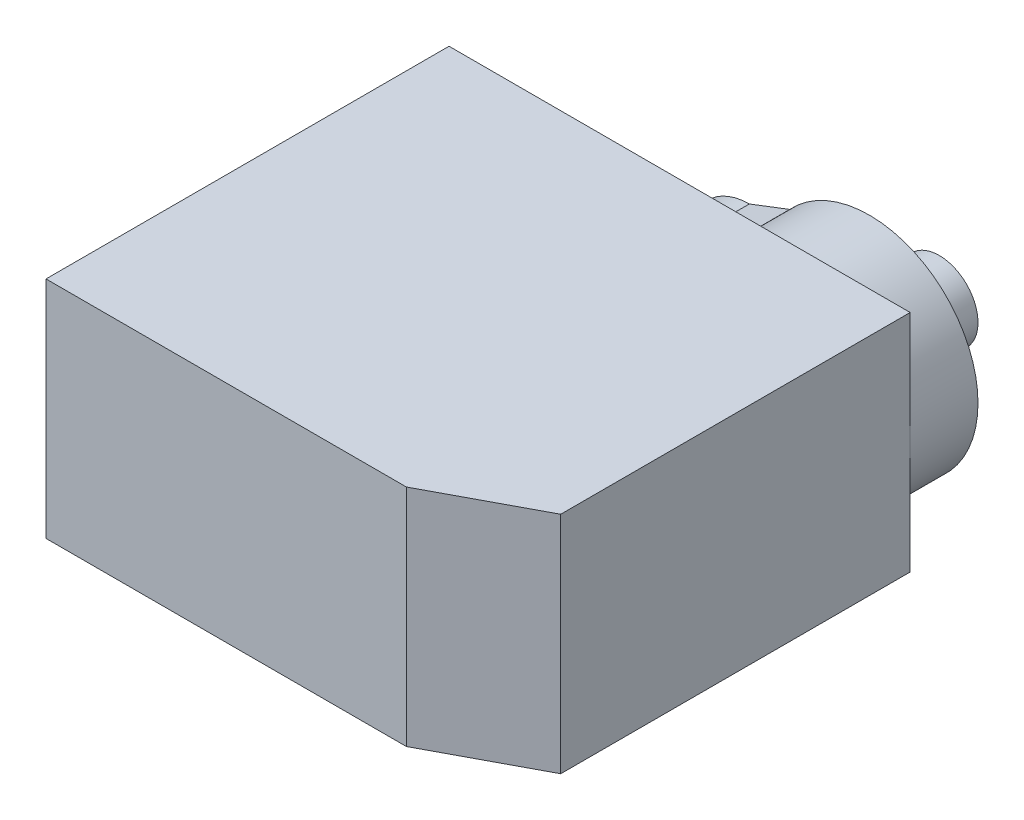
ISO-10303-21;
HEADER;
FILE_DESCRIPTION(('STEP AP214'),'2;1');
FILE_NAME('part.step','',(''),(''),'','','');
FILE_SCHEMA(('AUTOMOTIVE_DESIGN { 1 0 10303 214 1 1 1 1 }'));
ENDSEC;
DATA;
#1=APPLICATION_CONTEXT('core data for automotive mechanical design processes');
#2=APPLICATION_PROTOCOL_DEFINITION('international standard','automotive_design',2000,#1);
#3=PRODUCT_CONTEXT('',#1,'mechanical');
#4=PRODUCT('Part','Part','',(#3));
#5=PRODUCT_RELATED_PRODUCT_CATEGORY('part','',(#4));
#6=PRODUCT_DEFINITION_FORMATION('','',#4);
#7=PRODUCT_DEFINITION_CONTEXT('part definition',#1,'design');
#8=PRODUCT_DEFINITION('design','',#6,#7);
#9=PRODUCT_DEFINITION_SHAPE('','',#8);
#10=(LENGTH_UNIT() NAMED_UNIT(*) SI_UNIT(.MILLI.,.METRE.));
#11=(NAMED_UNIT(*) PLANE_ANGLE_UNIT() SI_UNIT($,.RADIAN.));
#12=(NAMED_UNIT(*) SI_UNIT($,.STERADIAN.) SOLID_ANGLE_UNIT());
#13=UNCERTAINTY_MEASURE_WITH_UNIT(LENGTH_MEASURE(1.E-05),#10,'distance_accuracy_value','');
#14=(GEOMETRIC_REPRESENTATION_CONTEXT(3) GLOBAL_UNCERTAINTY_ASSIGNED_CONTEXT((#13)) GLOBAL_UNIT_ASSIGNED_CONTEXT((#10,
#11,#12)) REPRESENTATION_CONTEXT('',''));
#15=CARTESIAN_POINT('',(0.,0.,0.));
#16=DIRECTION('',(0.,0.,1.));
#17=DIRECTION('',(1.,0.,0.));
#18=AXIS2_PLACEMENT_3D('',#15,#16,#17);
#19=CARTESIAN_POINT('',(0.,11.6,-20.8));
#20=DIRECTION('',(0.,0.,1.));
#21=DIRECTION('',(1.,0.,0.));
#22=AXIS2_PLACEMENT_3D('',#19,#20,#21);
#23=PLANE('',#22);
#24=CARTESIAN_POINT('',(18.2,5.8,-20.8));
#25=DIRECTION('',(0.,0.,-1.));
#26=DIRECTION('',(-1.,0.,0.));
#27=AXIS2_PLACEMENT_3D('',#24,#25,#26);
#28=CIRCLE('',#27,5.6);
#29=CARTESIAN_POINT('',(14.0866072397594,9.6,-20.8));
#30=VERTEX_POINT('',#29);
#31=CARTESIAN_POINT('',(23.8,5.8,-20.8));
#32=VERTEX_POINT('',#31);
#33=EDGE_CURVE('E42',#30,#32,#28,.T.);
#34=ORIENTED_EDGE('',*,*,#33,.F.);
#35=DIRECTION('',(0.93372609115302,0.357988249388303,0.));
#36=VECTOR('',#35,1.);
#37=CARTESIAN_POINT('',(14.0866072397594,9.6,-20.8));
#38=LINE('',#37,#36);
#39=CARTESIAN_POINT('',(12.,8.8,-20.8));
#40=VERTEX_POINT('',#39);
#41=EDGE_CURVE('E52',#40,#30,#38,.T.);
#42=ORIENTED_EDGE('',*,*,#41,.F.);
#43=CARTESIAN_POINT('',(12.,5.8,-20.8));
#44=DIRECTION('',(0.,0.,-1.));
#45=DIRECTION('',(-1.,0.,0.));
#46=AXIS2_PLACEMENT_3D('',#43,#44,#45);
#47=CIRCLE('',#46,3.);
#48=CARTESIAN_POINT('',(12.,2.8,-20.8));
#49=VERTEX_POINT('',#48);
#50=EDGE_CURVE('E195',#49,#40,#47,.T.);
#51=ORIENTED_EDGE('',*,*,#50,.F.);
#52=DIRECTION('',(-0.93372609115302,0.357988249388302,0.));
#53=VECTOR('',#52,1.);
#54=CARTESIAN_POINT('',(14.0866072397594,2.,-20.8));
#55=LINE('',#54,#53);
#56=CARTESIAN_POINT('',(14.0866072397594,2.,-20.8));
#57=VERTEX_POINT('',#56);
#58=EDGE_CURVE('E193',#57,#49,#55,.T.);
#59=ORIENTED_EDGE('',*,*,#58,.F.);
#60=EDGE_CURVE('E11',#32,#57,#28,.T.);
#61=ORIENTED_EDGE('',*,*,#60,.F.);
#62=DIRECTION('',(0.,-1.,0.));
#63=VECTOR('',#62,1.);
#64=CARTESIAN_POINT('',(23.8,11.6,-20.8));
#65=LINE('',#64,#63);
#66=CARTESIAN_POINT('',(23.8,0.,-20.8));
#67=VERTEX_POINT('',#66);
#68=EDGE_CURVE('E159',#32,#67,#65,.T.);
#69=ORIENTED_EDGE('',*,*,#68,.T.);
#70=DIRECTION('',(-1.,0.,0.));
#71=VECTOR('',#70,1.);
#72=CARTESIAN_POINT('',(0.,0.,-20.8));
#73=LINE('',#72,#71);
#74=CARTESIAN_POINT('',(0.,0.,-20.8));
#75=VERTEX_POINT('',#74);
#76=EDGE_CURVE('E141',#67,#75,#73,.T.);
#77=ORIENTED_EDGE('',*,*,#76,.T.);
#78=DIRECTION('',(0.,-1.,0.));
#79=VECTOR('',#78,1.);
#80=CARTESIAN_POINT('',(0.,11.6,-20.8));
#81=LINE('',#80,#79);
#82=CARTESIAN_POINT('',(0.,11.6,-20.8));
#83=VERTEX_POINT('',#82);
#84=EDGE_CURVE('E148',#83,#75,#81,.T.);
#85=ORIENTED_EDGE('',*,*,#84,.F.);
#86=DIRECTION('',(-1.,0.,0.));
#87=VECTOR('',#86,1.);
#88=CARTESIAN_POINT('',(0.,11.6,-20.8));
#89=LINE('',#88,#87);
#90=CARTESIAN_POINT('',(23.8,11.6,-20.8));
#91=VERTEX_POINT('',#90);
#92=EDGE_CURVE('E147',#91,#83,#89,.T.);
#93=ORIENTED_EDGE('',*,*,#92,.F.);
#94=EDGE_CURVE('E160',#91,#32,#65,.T.);
#95=ORIENTED_EDGE('',*,*,#94,.T.);
#96=EDGE_LOOP('',(#34,#42,#51,#59,#61,#69,#77,#85,#93,#95));
#97=FACE_BOUND('',#96,.T.);
#98=ADVANCED_FACE('F32',(#97),#23,.F.);
#99=CARTESIAN_POINT('',(0.,11.6,0.));
#100=DIRECTION('',(1.,0.,0.));
#101=DIRECTION('',(0.,0.,-1.));
#102=AXIS2_PLACEMENT_3D('',#99,#100,#101);
#103=PLANE('',#102);
#104=DIRECTION('',(0.,0.,1.));
#105=VECTOR('',#104,1.);
#106=CARTESIAN_POINT('',(0.,0.,0.));
#107=LINE('',#106,#105);
#108=CARTESIAN_POINT('',(0.,0.,0.));
#109=VERTEX_POINT('',#108);
#110=EDGE_CURVE('E128',#75,#109,#107,.T.);
#111=ORIENTED_EDGE('',*,*,#110,.T.);
#112=DIRECTION('',(0.,-1.,0.));
#113=VECTOR('',#112,1.);
#114=CARTESIAN_POINT('',(0.,11.6,0.));
#115=LINE('',#114,#113);
#116=CARTESIAN_POINT('',(0.,11.6,0.));
#117=VERTEX_POINT('',#116);
#118=EDGE_CURVE('E36',#117,#109,#115,.T.);
#119=ORIENTED_EDGE('',*,*,#118,.F.);
#120=DIRECTION('',(0.,0.,1.));
#121=VECTOR('',#120,1.);
#122=CARTESIAN_POINT('',(0.,11.6,0.));
#123=LINE('',#122,#121);
#124=EDGE_CURVE('E137',#83,#117,#123,.T.);
#125=ORIENTED_EDGE('',*,*,#124,.F.);
#126=ORIENTED_EDGE('',*,*,#84,.T.);
#127=EDGE_LOOP('',(#111,#119,#125,#126));
#128=FACE_BOUND('',#127,.T.);
#129=ADVANCED_FACE('F34',(#128),#103,.F.);
#130=CARTESIAN_POINT('',(0.,11.6,0.));
#131=DIRECTION('',(0.,0.,-1.));
#132=DIRECTION('',(-1.,0.,0.));
#133=AXIS2_PLACEMENT_3D('',#130,#131,#132);
#134=PLANE('',#133);
#135=DIRECTION('',(1.,0.,0.));
#136=VECTOR('',#135,1.);
#137=CARTESIAN_POINT('',(0.,0.,0.));
#138=LINE('',#137,#136);
#139=CARTESIAN_POINT('',(18.6,0.,0.));
#140=VERTEX_POINT('',#139);
#141=EDGE_CURVE('E131',#109,#140,#138,.T.);
#142=ORIENTED_EDGE('',*,*,#141,.T.);
#143=DIRECTION('',(0.,-1.,0.));
#144=VECTOR('',#143,1.);
#145=CARTESIAN_POINT('',(18.6,11.6,0.));
#146=LINE('',#145,#144);
#147=CARTESIAN_POINT('',(18.6,11.6,0.));
#148=VERTEX_POINT('',#147);
#149=EDGE_CURVE('E164',#148,#140,#146,.T.);
#150=ORIENTED_EDGE('',*,*,#149,.F.);
#151=DIRECTION('',(1.,0.,0.));
#152=VECTOR('',#151,1.);
#153=CARTESIAN_POINT('',(0.,11.6,0.));
#154=LINE('',#153,#152);
#155=EDGE_CURVE('E140',#117,#148,#154,.T.);
#156=ORIENTED_EDGE('',*,*,#155,.F.);
#157=ORIENTED_EDGE('',*,*,#118,.T.);
#158=EDGE_LOOP('',(#142,#150,#156,#157));
#159=FACE_BOUND('',#158,.T.);
#160=ADVANCED_FACE('F173',(#159),#134,.F.);
#161=CARTESIAN_POINT('',(18.6,11.6,0.));
#162=DIRECTION('',(-0.469471562785891,0.,-0.882947592858927));
#163=DIRECTION('',(-0.882947592858927,0.,0.469471562785892));
#164=AXIS2_PLACEMENT_3D('',#161,#162,#163);
#165=PLANE('',#164);
#166=DIRECTION('',(0.882947592858927,0.,-0.469471562785891));
#167=VECTOR('',#166,1.);
#168=CARTESIAN_POINT('',(18.6,0.,0.));
#169=LINE('',#168,#167);
#170=CARTESIAN_POINT('',(23.8,0.,-2.76488904463969));
#171=VERTEX_POINT('',#170);
#172=EDGE_CURVE('E151',#140,#171,#169,.T.);
#173=ORIENTED_EDGE('',*,*,#172,.T.);
#174=DIRECTION('',(0.,-1.,0.));
#175=VECTOR('',#174,1.);
#176=CARTESIAN_POINT('',(23.8,11.6,-2.76488904463969));
#177=LINE('',#176,#175);
#178=CARTESIAN_POINT('',(23.8,11.6,-2.76488904463969));
#179=VERTEX_POINT('',#178);
#180=EDGE_CURVE('E162',#179,#171,#177,.T.);
#181=ORIENTED_EDGE('',*,*,#180,.F.);
#182=DIRECTION('',(0.882947592858927,0.,-0.469471562785891));
#183=VECTOR('',#182,1.);
#184=CARTESIAN_POINT('',(18.6,11.6,0.));
#185=LINE('',#184,#183);
#186=EDGE_CURVE('E143',#148,#179,#185,.T.);
#187=ORIENTED_EDGE('',*,*,#186,.F.);
#188=ORIENTED_EDGE('',*,*,#149,.T.);
#189=EDGE_LOOP('',(#173,#181,#187,#188));
#190=FACE_BOUND('',#189,.T.);
#191=ADVANCED_FACE('F183',(#190),#165,.F.);
#192=CARTESIAN_POINT('',(23.8,11.6,-2.76488904463969));
#193=DIRECTION('',(-1.,0.,0.));
#194=DIRECTION('',(0.,0.,1.));
#195=AXIS2_PLACEMENT_3D('',#192,#193,#194);
#196=PLANE('',#195);
#197=DIRECTION('',(0.,0.,-1.));
#198=VECTOR('',#197,1.);
#199=CARTESIAN_POINT('',(23.8,0.,-2.76488904463969));
#200=LINE('',#199,#198);
#201=EDGE_CURVE('E153',#171,#67,#200,.T.);
#202=ORIENTED_EDGE('',*,*,#201,.T.);
#203=ORIENTED_EDGE('',*,*,#68,.F.);
#204=ORIENTED_EDGE('',*,*,#94,.F.);
#205=DIRECTION('',(0.,0.,-1.));
#206=VECTOR('',#205,1.);
#207=CARTESIAN_POINT('',(23.8,11.6,-2.76488904463969));
#208=LINE('',#207,#206);
#209=EDGE_CURVE('E145',#179,#91,#208,.T.);
#210=ORIENTED_EDGE('',*,*,#209,.F.);
#211=ORIENTED_EDGE('',*,*,#180,.T.);
#212=EDGE_LOOP('',(#202,#203,#204,#210,#211));
#213=FACE_BOUND('',#212,.T.);
#214=ADVANCED_FACE('F186',(#213),#196,.F.);
#215=CARTESIAN_POINT('',(0.,11.6,0.));
#216=DIRECTION('',(0.,-1.,0.));
#217=DIRECTION('',(0.,0.,-1.));
#218=AXIS2_PLACEMENT_3D('',#215,#216,#217);
#219=PLANE('',#218);
#220=ORIENTED_EDGE('',*,*,#124,.T.);
#221=ORIENTED_EDGE('',*,*,#155,.T.);
#222=ORIENTED_EDGE('',*,*,#186,.T.);
#223=ORIENTED_EDGE('',*,*,#209,.T.);
#224=ORIENTED_EDGE('',*,*,#92,.T.);
#225=EDGE_LOOP('',(#220,#221,#222,#223,#224));
#226=FACE_BOUND('',#225,.T.);
#227=ADVANCED_FACE('F191',(#226),#219,.F.);
#228=CARTESIAN_POINT('',(0.,0.,0.));
#229=DIRECTION('',(0.,-1.,0.));
#230=DIRECTION('',(0.,0.,-1.));
#231=AXIS2_PLACEMENT_3D('',#228,#229,#230);
#232=PLANE('',#231);
#233=ORIENTED_EDGE('',*,*,#110,.F.);
#234=ORIENTED_EDGE('',*,*,#76,.F.);
#235=ORIENTED_EDGE('',*,*,#201,.F.);
#236=ORIENTED_EDGE('',*,*,#172,.F.);
#237=ORIENTED_EDGE('',*,*,#141,.F.);
#238=EDGE_LOOP('',(#233,#234,#235,#236,#237));
#239=FACE_BOUND('',#238,.T.);
#240=ADVANCED_FACE('F180',(#239),#232,.T.);
#241=CARTESIAN_POINT('',(18.2,5.8,-24.3));
#242=DIRECTION('',(0.,0.,1.));
#243=DIRECTION('',(1.,0.,0.));
#244=AXIS2_PLACEMENT_3D('',#241,#242,#243);
#245=CYLINDRICAL_SURFACE('',#244,5.6);
#246=ORIENTED_EDGE('',*,*,#33,.T.);
#247=ORIENTED_EDGE('',*,*,#60,.T.);
#248=DIRECTION('',(0.,0.,1.));
#249=VECTOR('',#248,1.);
#250=CARTESIAN_POINT('',(14.0866072397594,2.,-24.3));
#251=LINE('',#250,#249);
#252=CARTESIAN_POINT('',(14.0866072397594,2.,-24.3));
#253=VERTEX_POINT('',#252);
#254=EDGE_CURVE('E111',#253,#57,#251,.T.);
#255=ORIENTED_EDGE('',*,*,#254,.F.);
#256=CARTESIAN_POINT('',(18.2,5.8,-24.3));
#257=DIRECTION('',(0.,0.,-1.));
#258=DIRECTION('',(-1.,0.,0.));
#259=AXIS2_PLACEMENT_3D('',#256,#257,#258);
#260=CIRCLE('',#259,5.6);
#261=CARTESIAN_POINT('',(14.0866072397594,9.6,-24.3));
#262=VERTEX_POINT('',#261);
#263=EDGE_CURVE('E117',#262,#253,#260,.T.);
#264=ORIENTED_EDGE('',*,*,#263,.F.);
#265=DIRECTION('',(0.,0.,1.));
#266=VECTOR('',#265,1.);
#267=CARTESIAN_POINT('',(14.0866072397594,9.6,-24.3));
#268=LINE('',#267,#266);
#269=EDGE_CURVE('E192',#262,#30,#268,.T.);
#270=ORIENTED_EDGE('',*,*,#269,.T.);
#271=EDGE_LOOP('',(#246,#247,#255,#264,#270));
#272=FACE_BOUND('',#271,.T.);
#273=ADVANCED_FACE('F127',(#272),#245,.T.);
#274=CARTESIAN_POINT('',(14.0866072397594,2.,-24.3));
#275=DIRECTION('',(0.357988249388302,0.933726091153021,0.));
#276=DIRECTION('',(-0.933726091153021,0.357988249388302,0.));
#277=AXIS2_PLACEMENT_3D('',#274,#275,#276);
#278=PLANE('',#277);
#279=ORIENTED_EDGE('',*,*,#58,.T.);
#280=DIRECTION('',(0.,0.,1.));
#281=VECTOR('',#280,1.);
#282=CARTESIAN_POINT('',(12.,2.8,-24.3));
#283=LINE('',#282,#281);
#284=CARTESIAN_POINT('',(12.,2.8,-24.3));
#285=VERTEX_POINT('',#284);
#286=EDGE_CURVE('E113',#285,#49,#283,.T.);
#287=ORIENTED_EDGE('',*,*,#286,.F.);
#288=DIRECTION('',(-0.93372609115302,0.357988249388302,0.));
#289=VECTOR('',#288,1.);
#290=CARTESIAN_POINT('',(14.0866072397594,2.,-24.3));
#291=LINE('',#290,#289);
#292=EDGE_CURVE('E106',#253,#285,#291,.T.);
#293=ORIENTED_EDGE('',*,*,#292,.F.);
#294=ORIENTED_EDGE('',*,*,#254,.T.);
#295=EDGE_LOOP('',(#279,#287,#293,#294));
#296=FACE_BOUND('',#295,.T.);
#297=ADVANCED_FACE('F109',(#296),#278,.F.);
#298=CARTESIAN_POINT('',(12.,5.8,-24.3));
#299=DIRECTION('',(0.,0.,1.));
#300=DIRECTION('',(1.,0.,0.));
#301=AXIS2_PLACEMENT_3D('',#298,#299,#300);
#302=CYLINDRICAL_SURFACE('',#301,3.);
#303=ORIENTED_EDGE('',*,*,#50,.T.);
#304=DIRECTION('',(0.,0.,1.));
#305=VECTOR('',#304,1.);
#306=CARTESIAN_POINT('',(12.,8.8,-24.3));
#307=LINE('',#306,#305);
#308=CARTESIAN_POINT('',(12.,8.8,-24.3));
#309=VERTEX_POINT('',#308);
#310=EDGE_CURVE('E133',#309,#40,#307,.T.);
#311=ORIENTED_EDGE('',*,*,#310,.F.);
#312=CARTESIAN_POINT('',(12.,5.8,-24.3));
#313=DIRECTION('',(0.,0.,-1.));
#314=DIRECTION('',(-1.,0.,0.));
#315=AXIS2_PLACEMENT_3D('',#312,#313,#314);
#316=CIRCLE('',#315,3.);
#317=EDGE_CURVE('E116',#285,#309,#316,.T.);
#318=ORIENTED_EDGE('',*,*,#317,.F.);
#319=ORIENTED_EDGE('',*,*,#286,.T.);
#320=EDGE_LOOP('',(#303,#311,#318,#319));
#321=FACE_BOUND('',#320,.T.);
#322=ADVANCED_FACE('F210',(#321),#302,.T.);
#323=CARTESIAN_POINT('',(14.0866072397594,9.6,-24.3));
#324=DIRECTION('',(0.357988249388303,-0.93372609115302,0.));
#325=DIRECTION('',(0.93372609115302,0.357988249388303,0.));
#326=AXIS2_PLACEMENT_3D('',#323,#324,#325);
#327=PLANE('',#326);
#328=ORIENTED_EDGE('',*,*,#41,.T.);
#329=ORIENTED_EDGE('',*,*,#269,.F.);
#330=DIRECTION('',(0.93372609115302,0.357988249388303,0.));
#331=VECTOR('',#330,1.);
#332=CARTESIAN_POINT('',(14.0866072397594,9.6,-24.3));
#333=LINE('',#332,#331);
#334=EDGE_CURVE('E122',#309,#262,#333,.T.);
#335=ORIENTED_EDGE('',*,*,#334,.F.);
#336=ORIENTED_EDGE('',*,*,#310,.T.);
#337=EDGE_LOOP('',(#328,#329,#335,#336));
#338=FACE_BOUND('',#337,.T.);
#339=ADVANCED_FACE('F208',(#338),#327,.F.);
#340=CARTESIAN_POINT('',(18.2,5.8,-24.3));
#341=DIRECTION('',(0.,0.,-1.));
#342=DIRECTION('',(-1.,0.,0.));
#343=AXIS2_PLACEMENT_3D('',#340,#341,#342);
#344=PLANE('',#343);
#345=CARTESIAN_POINT('',(18.2,5.8,-24.3));
#346=DIRECTION('',(0.,0.,-1.));
#347=DIRECTION('',(-1.,0.,0.));
#348=AXIS2_PLACEMENT_3D('',#345,#346,#347);
#349=CIRCLE('',#348,2.8);
#350=CARTESIAN_POINT('',(15.4,5.8,-24.3));
#351=VERTEX_POINT('',#350);
#352=EDGE_CURVE('E215',#351,#351,#349,.T.);
#353=ORIENTED_EDGE('',*,*,#352,.F.);
#354=EDGE_LOOP('',(#353));
#355=FACE_BOUND('',#354,.T.);
#356=CARTESIAN_POINT('',(11.2,5.8,-24.3));
#357=DIRECTION('',(0.,0.,-1.));
#358=DIRECTION('',(-1.,0.,0.));
#359=AXIS2_PLACEMENT_3D('',#356,#357,#358);
#360=CIRCLE('',#359,1.);
#361=CARTESIAN_POINT('',(10.2,5.8,-24.3));
#362=VERTEX_POINT('',#361);
#363=EDGE_CURVE('E198',#362,#362,#360,.T.);
#364=ORIENTED_EDGE('',*,*,#363,.F.);
#365=EDGE_LOOP('',(#364));
#366=FACE_BOUND('',#365,.T.);
#367=ORIENTED_EDGE('',*,*,#263,.T.);
#368=ORIENTED_EDGE('',*,*,#292,.T.);
#369=ORIENTED_EDGE('',*,*,#317,.T.);
#370=ORIENTED_EDGE('',*,*,#334,.T.);
#371=EDGE_LOOP('',(#367,#368,#369,#370));
#372=FACE_BOUND('',#371,.T.);
#373=ADVANCED_FACE('F120',(#355,#366,#372),#344,.T.);
#374=CARTESIAN_POINT('',(11.2,5.8,-25.3));
#375=DIRECTION('',(0.,0.,1.));
#376=DIRECTION('',(1.,0.,0.));
#377=AXIS2_PLACEMENT_3D('',#374,#375,#376);
#378=CYLINDRICAL_SURFACE('',#377,1.);
#379=CARTESIAN_POINT('',(11.2,5.8,-25.3));
#380=DIRECTION('',(0.,0.,-1.));
#381=DIRECTION('',(-1.,0.,0.));
#382=AXIS2_PLACEMENT_3D('',#379,#380,#381);
#383=CIRCLE('',#382,1.);
#384=CARTESIAN_POINT('',(10.2,5.8,-25.3));
#385=VERTEX_POINT('',#384);
#386=EDGE_CURVE('E194',#385,#385,#383,.T.);
#387=ORIENTED_EDGE('',*,*,#386,.F.);
#388=EDGE_LOOP('',(#387));
#389=FACE_BOUND('',#388,.T.);
#390=ORIENTED_EDGE('',*,*,#363,.T.);
#391=EDGE_LOOP('',(#390));
#392=FACE_BOUND('',#391,.T.);
#393=ADVANCED_FACE('F250',(#389,#392),#378,.T.);
#394=CARTESIAN_POINT('',(11.2,5.8,-25.3));
#395=DIRECTION('',(0.,0.,-1.));
#396=DIRECTION('',(-1.,0.,0.));
#397=AXIS2_PLACEMENT_3D('',#394,#395,#396);
#398=PLANE('',#397);
#399=ORIENTED_EDGE('',*,*,#386,.T.);
#400=EDGE_LOOP('',(#399));
#401=FACE_BOUND('',#400,.T.);
#402=ADVANCED_FACE('F244',(#401),#398,.T.);
#403=CARTESIAN_POINT('',(18.2,5.8,-24.7));
#404=DIRECTION('',(0.,0.,1.));
#405=DIRECTION('',(1.,0.,0.));
#406=AXIS2_PLACEMENT_3D('',#403,#404,#405);
#407=CYLINDRICAL_SURFACE('',#406,2.8);
#408=CARTESIAN_POINT('',(18.2,5.8,-24.7));
#409=DIRECTION('',(0.,0.,-1.));
#410=DIRECTION('',(-1.,0.,0.));
#411=AXIS2_PLACEMENT_3D('',#408,#409,#410);
#412=CIRCLE('',#411,2.8);
#413=CARTESIAN_POINT('',(15.4,5.8,-24.7));
#414=VERTEX_POINT('',#413);
#415=EDGE_CURVE('E213',#414,#414,#412,.T.);
#416=ORIENTED_EDGE('',*,*,#415,.F.);
#417=EDGE_LOOP('',(#416));
#418=FACE_BOUND('',#417,.T.);
#419=ORIENTED_EDGE('',*,*,#352,.T.);
#420=EDGE_LOOP('',(#419));
#421=FACE_BOUND('',#420,.T.);
#422=ADVANCED_FACE('F238',(#418,#421),#407,.T.);
#423=CARTESIAN_POINT('',(18.2,5.8,-24.7));
#424=DIRECTION('',(0.,0.,-1.));
#425=DIRECTION('',(-1.,0.,0.));
#426=AXIS2_PLACEMENT_3D('',#423,#424,#425);
#427=PLANE('',#426);
#428=CARTESIAN_POINT('',(18.2,5.8,-24.7));
#429=DIRECTION('',(0.,0.,-1.));
#430=DIRECTION('',(-1.,0.,0.));
#431=AXIS2_PLACEMENT_3D('',#428,#429,#430);
#432=CIRCLE('',#431,2.);
#433=CARTESIAN_POINT('',(16.2,5.8,-24.7));
#434=VERTEX_POINT('',#433);
#435=EDGE_CURVE('E221',#434,#434,#432,.T.);
#436=ORIENTED_EDGE('',*,*,#435,.F.);
#437=EDGE_LOOP('',(#436));
#438=FACE_BOUND('',#437,.T.);
#439=ORIENTED_EDGE('',*,*,#415,.T.);
#440=EDGE_LOOP('',(#439));
#441=FACE_BOUND('',#440,.T.);
#442=ADVANCED_FACE('F232',(#438,#441),#427,.T.);
#443=CARTESIAN_POINT('',(18.2,5.8,-27.9));
#444=DIRECTION('',(0.,0.,1.));
#445=DIRECTION('',(1.,0.,0.));
#446=AXIS2_PLACEMENT_3D('',#443,#444,#445);
#447=CYLINDRICAL_SURFACE('',#446,2.);
#448=CARTESIAN_POINT('',(18.2,5.8,-27.9));
#449=DIRECTION('',(0.,0.,-1.));
#450=DIRECTION('',(-1.,0.,0.));
#451=AXIS2_PLACEMENT_3D('',#448,#449,#450);
#452=CIRCLE('',#451,2.);
#453=CARTESIAN_POINT('',(16.2,5.8,-27.9));
#454=VERTEX_POINT('',#453);
#455=EDGE_CURVE('E218',#454,#454,#452,.T.);
#456=ORIENTED_EDGE('',*,*,#455,.F.);
#457=EDGE_LOOP('',(#456));
#458=FACE_BOUND('',#457,.T.);
#459=ORIENTED_EDGE('',*,*,#435,.T.);
#460=EDGE_LOOP('',(#459));
#461=FACE_BOUND('',#460,.T.);
#462=ADVANCED_FACE('F229',(#458,#461),#447,.T.);
#463=CARTESIAN_POINT('',(18.2,5.8,-27.9));
#464=DIRECTION('',(0.,0.,-1.));
#465=DIRECTION('',(-1.,0.,0.));
#466=AXIS2_PLACEMENT_3D('',#463,#464,#465);
#467=PLANE('',#466);
#468=ORIENTED_EDGE('',*,*,#455,.T.);
#469=EDGE_LOOP('',(#468));
#470=FACE_BOUND('',#469,.T.);
#471=ADVANCED_FACE('F227',(#470),#467,.T.);
#472=CLOSED_SHELL('',(#98,#129,#160,#191,#214,#227,#240,#273,#297,#322,#339,#373,#393,#402,#422,
#442,#462,#471));
#473=MANIFOLD_SOLID_BREP('B2',#472);
#474=ADVANCED_BREP_SHAPE_REPRESENTATION('',(#18,#473),#14);
#475=SHAPE_DEFINITION_REPRESENTATION(#9,#474);
ENDSEC;
END-ISO-10303-21;
